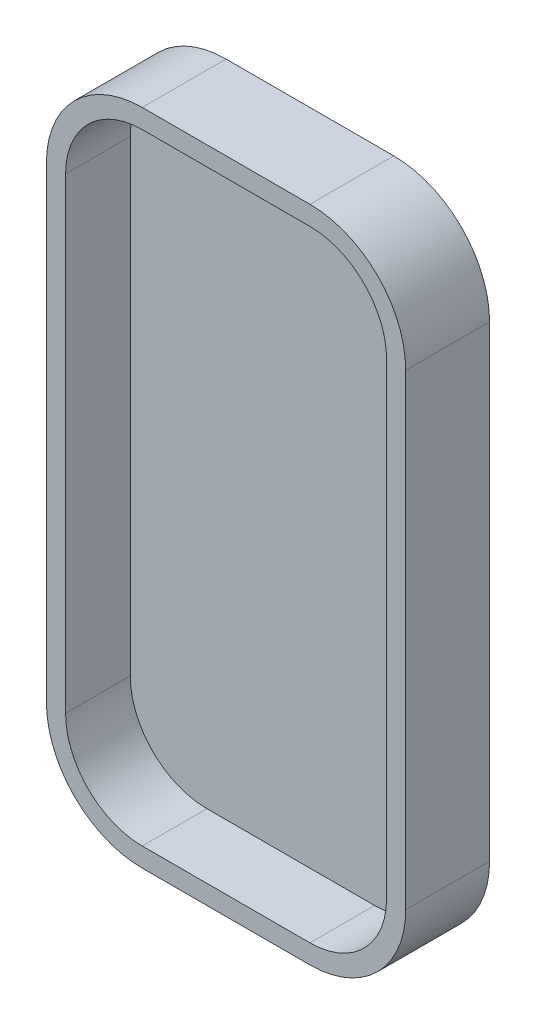
ISO-10303-21;
HEADER;
FILE_DESCRIPTION(('STEP AP214'),'2;1');
FILE_NAME('part.step','',(''),(''),'','','');
FILE_SCHEMA(('AUTOMOTIVE_DESIGN { 1 0 10303 214 1 1 1 1 }'));
ENDSEC;
DATA;
#1=APPLICATION_CONTEXT('core data for automotive mechanical design processes');
#2=APPLICATION_PROTOCOL_DEFINITION('international standard','automotive_design',2000,#1);
#3=PRODUCT_CONTEXT('',#1,'mechanical');
#4=PRODUCT('Part','Part','',(#3));
#5=PRODUCT_RELATED_PRODUCT_CATEGORY('part','',(#4));
#6=PRODUCT_DEFINITION_FORMATION('','',#4);
#7=PRODUCT_DEFINITION_CONTEXT('part definition',#1,'design');
#8=PRODUCT_DEFINITION('design','',#6,#7);
#9=PRODUCT_DEFINITION_SHAPE('','',#8);
#10=(LENGTH_UNIT() NAMED_UNIT(*) SI_UNIT(.MILLI.,.METRE.));
#11=(NAMED_UNIT(*) PLANE_ANGLE_UNIT() SI_UNIT($,.RADIAN.));
#12=(NAMED_UNIT(*) SI_UNIT($,.STERADIAN.) SOLID_ANGLE_UNIT());
#13=UNCERTAINTY_MEASURE_WITH_UNIT(LENGTH_MEASURE(1.E-05),#10,'distance_accuracy_value','');
#14=(GEOMETRIC_REPRESENTATION_CONTEXT(3) GLOBAL_UNCERTAINTY_ASSIGNED_CONTEXT((#13)) GLOBAL_UNIT_ASSIGNED_CONTEXT((#10,
#11,#12)) REPRESENTATION_CONTEXT('',''));
#15=CARTESIAN_POINT('',(0.,0.,0.));
#16=DIRECTION('',(0.,0.,1.));
#17=DIRECTION('',(1.,0.,0.));
#18=AXIS2_PLACEMENT_3D('',#15,#16,#17);
#19=CARTESIAN_POINT('',(-7.,-19.5,7.));
#20=DIRECTION('',(0.,0.,-1.));
#21=DIRECTION('',(-1.,0.,0.));
#22=AXIS2_PLACEMENT_3D('',#19,#20,#21);
#23=CYLINDRICAL_SURFACE('',#22,8.);
#24=CARTESIAN_POINT('',(-7.,-19.5,0.));
#25=DIRECTION('',(0.,0.,1.));
#26=DIRECTION('',(1.,0.,0.));
#27=AXIS2_PLACEMENT_3D('',#24,#25,#26);
#28=CIRCLE('',#27,8.);
#29=CARTESIAN_POINT('',(-15.,-19.4999999999999,0.));
#30=VERTEX_POINT('',#29);
#31=CARTESIAN_POINT('',(-6.99999999999994,-27.5,0.));
#32=VERTEX_POINT('',#31);
#33=EDGE_CURVE('E151',#30,#32,#28,.T.);
#34=ORIENTED_EDGE('',*,*,#33,.T.);
#35=DIRECTION('',(0.,0.,-1.));
#36=VECTOR('',#35,1.);
#37=CARTESIAN_POINT('',(-6.99999999999994,-27.5,7.));
#38=LINE('',#37,#36);
#39=CARTESIAN_POINT('',(-6.99999999999994,-27.5,7.));
#40=VERTEX_POINT('',#39);
#41=EDGE_CURVE('E11',#40,#32,#38,.T.);
#42=ORIENTED_EDGE('',*,*,#41,.F.);
#43=CARTESIAN_POINT('',(-7.,-19.5,7.));
#44=DIRECTION('',(0.,0.,1.));
#45=DIRECTION('',(1.,0.,0.));
#46=AXIS2_PLACEMENT_3D('',#43,#44,#45);
#47=CIRCLE('',#46,8.);
#48=CARTESIAN_POINT('',(-15.,-19.4999999999999,7.));
#49=VERTEX_POINT('',#48);
#50=EDGE_CURVE('E167',#49,#40,#47,.T.);
#51=ORIENTED_EDGE('',*,*,#50,.F.);
#52=DIRECTION('',(0.,0.,-1.));
#53=VECTOR('',#52,1.);
#54=CARTESIAN_POINT('',(-15.,-19.4999999999999,7.));
#55=LINE('',#54,#53);
#56=EDGE_CURVE('E147',#49,#30,#55,.T.);
#57=ORIENTED_EDGE('',*,*,#56,.T.);
#58=EDGE_LOOP('',(#34,#42,#51,#57));
#59=FACE_BOUND('',#58,.T.);
#60=ADVANCED_FACE('F43',(#59),#23,.T.);
#61=CARTESIAN_POINT('',(-6.99999999999994,-27.5,7.));
#62=DIRECTION('',(0.,1.,0.));
#63=DIRECTION('',(-1.,0.,0.));
#64=AXIS2_PLACEMENT_3D('',#61,#62,#63);
#65=PLANE('',#64);
#66=DIRECTION('',(1.,0.,0.));
#67=VECTOR('',#66,1.);
#68=CARTESIAN_POINT('',(-6.99999999999994,-27.5,0.));
#69=LINE('',#68,#67);
#70=CARTESIAN_POINT('',(6.99999999999994,-27.5,0.));
#71=VERTEX_POINT('',#70);
#72=EDGE_CURVE('E154',#32,#71,#69,.T.);
#73=ORIENTED_EDGE('',*,*,#72,.T.);
#74=DIRECTION('',(0.,0.,-1.));
#75=VECTOR('',#74,1.);
#76=CARTESIAN_POINT('',(6.99999999999994,-27.5,7.));
#77=LINE('',#76,#75);
#78=CARTESIAN_POINT('',(6.99999999999994,-27.5,7.));
#79=VERTEX_POINT('',#78);
#80=EDGE_CURVE('E50',#79,#71,#77,.T.);
#81=ORIENTED_EDGE('',*,*,#80,.F.);
#82=DIRECTION('',(1.,0.,0.));
#83=VECTOR('',#82,1.);
#84=CARTESIAN_POINT('',(-6.99999999999994,-27.5,7.));
#85=LINE('',#84,#83);
#86=EDGE_CURVE('E107',#40,#79,#85,.T.);
#87=ORIENTED_EDGE('',*,*,#86,.F.);
#88=ORIENTED_EDGE('',*,*,#41,.T.);
#89=EDGE_LOOP('',(#73,#81,#87,#88));
#90=FACE_BOUND('',#89,.T.);
#91=ADVANCED_FACE('F341',(#90),#65,.F.);
#92=CARTESIAN_POINT('',(7.,-19.5,7.));
#93=DIRECTION('',(0.,0.,-1.));
#94=DIRECTION('',(-1.,0.,0.));
#95=AXIS2_PLACEMENT_3D('',#92,#93,#94);
#96=CYLINDRICAL_SURFACE('',#95,8.);
#97=CARTESIAN_POINT('',(7.,-19.5,0.));
#98=DIRECTION('',(0.,0.,1.));
#99=DIRECTION('',(1.,0.,0.));
#100=AXIS2_PLACEMENT_3D('',#97,#98,#99);
#101=CIRCLE('',#100,8.);
#102=CARTESIAN_POINT('',(15.,-19.4999999999999,0.));
#103=VERTEX_POINT('',#102);
#104=EDGE_CURVE('E157',#71,#103,#101,.T.);
#105=ORIENTED_EDGE('',*,*,#104,.T.);
#106=DIRECTION('',(0.,0.,-1.));
#107=VECTOR('',#106,1.);
#108=CARTESIAN_POINT('',(15.,-19.4999999999999,7.));
#109=LINE('',#108,#107);
#110=CARTESIAN_POINT('',(15.,-19.4999999999999,7.));
#111=VERTEX_POINT('',#110);
#112=EDGE_CURVE('E174',#111,#103,#109,.T.);
#113=ORIENTED_EDGE('',*,*,#112,.F.);
#114=CARTESIAN_POINT('',(7.,-19.5,7.));
#115=DIRECTION('',(0.,0.,1.));
#116=DIRECTION('',(1.,0.,0.));
#117=AXIS2_PLACEMENT_3D('',#114,#115,#116);
#118=CIRCLE('',#117,8.);
#119=EDGE_CURVE('E182',#79,#111,#118,.T.);
#120=ORIENTED_EDGE('',*,*,#119,.F.);
#121=ORIENTED_EDGE('',*,*,#80,.T.);
#122=EDGE_LOOP('',(#105,#113,#120,#121));
#123=FACE_BOUND('',#122,.T.);
#124=ADVANCED_FACE('F180',(#123),#96,.T.);
#125=CARTESIAN_POINT('',(15.,-19.4999999999999,7.));
#126=DIRECTION('',(-1.,0.,0.));
#127=DIRECTION('',(0.,0.,1.));
#128=AXIS2_PLACEMENT_3D('',#125,#126,#127);
#129=PLANE('',#128);
#130=DIRECTION('',(0.,1.,0.));
#131=VECTOR('',#130,1.);
#132=CARTESIAN_POINT('',(15.,-19.4999999999999,0.));
#133=LINE('',#132,#131);
#134=CARTESIAN_POINT('',(15.,19.4999999999999,0.));
#135=VERTEX_POINT('',#134);
#136=EDGE_CURVE('E159',#103,#135,#133,.T.);
#137=ORIENTED_EDGE('',*,*,#136,.T.);
#138=DIRECTION('',(0.,0.,-1.));
#139=VECTOR('',#138,1.);
#140=CARTESIAN_POINT('',(15.,19.4999999999999,7.));
#141=LINE('',#140,#139);
#142=CARTESIAN_POINT('',(15.,19.4999999999999,7.));
#143=VERTEX_POINT('',#142);
#144=EDGE_CURVE('E171',#143,#135,#141,.T.);
#145=ORIENTED_EDGE('',*,*,#144,.F.);
#146=DIRECTION('',(0.,1.,0.));
#147=VECTOR('',#146,1.);
#148=CARTESIAN_POINT('',(15.,-19.4999999999999,7.));
#149=LINE('',#148,#147);
#150=EDGE_CURVE('E194',#111,#143,#149,.T.);
#151=ORIENTED_EDGE('',*,*,#150,.F.);
#152=ORIENTED_EDGE('',*,*,#112,.T.);
#153=EDGE_LOOP('',(#137,#145,#151,#152));
#154=FACE_BOUND('',#153,.T.);
#155=ADVANCED_FACE('F190',(#154),#129,.F.);
#156=CARTESIAN_POINT('',(7.,19.5,7.));
#157=DIRECTION('',(0.,0.,-1.));
#158=DIRECTION('',(-1.,0.,0.));
#159=AXIS2_PLACEMENT_3D('',#156,#157,#158);
#160=CYLINDRICAL_SURFACE('',#159,8.);
#161=CARTESIAN_POINT('',(7.,19.5,0.));
#162=DIRECTION('',(0.,0.,1.));
#163=DIRECTION('',(1.,0.,0.));
#164=AXIS2_PLACEMENT_3D('',#161,#162,#163);
#165=CIRCLE('',#164,8.);
#166=CARTESIAN_POINT('',(6.99999999999994,27.5,0.));
#167=VERTEX_POINT('',#166);
#168=EDGE_CURVE('E161',#135,#167,#165,.T.);
#169=ORIENTED_EDGE('',*,*,#168,.T.);
#170=DIRECTION('',(0.,0.,-1.));
#171=VECTOR('',#170,1.);
#172=CARTESIAN_POINT('',(6.99999999999994,27.5,7.));
#173=LINE('',#172,#171);
#174=CARTESIAN_POINT('',(6.99999999999994,27.5,7.));
#175=VERTEX_POINT('',#174);
#176=EDGE_CURVE('E142',#175,#167,#173,.T.);
#177=ORIENTED_EDGE('',*,*,#176,.F.);
#178=CARTESIAN_POINT('',(7.,19.5,7.));
#179=DIRECTION('',(0.,0.,1.));
#180=DIRECTION('',(1.,0.,0.));
#181=AXIS2_PLACEMENT_3D('',#178,#179,#180);
#182=CIRCLE('',#181,8.);
#183=EDGE_CURVE('E130',#143,#175,#182,.T.);
#184=ORIENTED_EDGE('',*,*,#183,.F.);
#185=ORIENTED_EDGE('',*,*,#144,.T.);
#186=EDGE_LOOP('',(#169,#177,#184,#185));
#187=FACE_BOUND('',#186,.T.);
#188=ADVANCED_FACE('F193',(#187),#160,.T.);
#189=CARTESIAN_POINT('',(-6.99999999999994,27.5,7.));
#190=DIRECTION('',(0.,-1.,0.));
#191=DIRECTION('',(1.,0.,0.));
#192=AXIS2_PLACEMENT_3D('',#189,#190,#191);
#193=PLANE('',#192);
#194=DIRECTION('',(-1.,0.,0.));
#195=VECTOR('',#194,1.);
#196=CARTESIAN_POINT('',(-6.99999999999994,27.5,0.));
#197=LINE('',#196,#195);
#198=CARTESIAN_POINT('',(-6.99999999999994,27.5,0.));
#199=VERTEX_POINT('',#198);
#200=EDGE_CURVE('E139',#167,#199,#197,.T.);
#201=ORIENTED_EDGE('',*,*,#200,.T.);
#202=DIRECTION('',(0.,0.,-1.));
#203=VECTOR('',#202,1.);
#204=CARTESIAN_POINT('',(-6.99999999999994,27.5,7.));
#205=LINE('',#204,#203);
#206=CARTESIAN_POINT('',(-6.99999999999994,27.5,7.));
#207=VERTEX_POINT('',#206);
#208=EDGE_CURVE('E136',#207,#199,#205,.T.);
#209=ORIENTED_EDGE('',*,*,#208,.F.);
#210=DIRECTION('',(-1.,0.,0.));
#211=VECTOR('',#210,1.);
#212=CARTESIAN_POINT('',(-6.99999999999994,27.5,7.));
#213=LINE('',#212,#211);
#214=EDGE_CURVE('E123',#175,#207,#213,.T.);
#215=ORIENTED_EDGE('',*,*,#214,.F.);
#216=ORIENTED_EDGE('',*,*,#176,.T.);
#217=EDGE_LOOP('',(#201,#209,#215,#216));
#218=FACE_BOUND('',#217,.T.);
#219=ADVANCED_FACE('F137',(#218),#193,.F.);
#220=CARTESIAN_POINT('',(-7.,19.5,7.));
#221=DIRECTION('',(0.,0.,-1.));
#222=DIRECTION('',(-1.,0.,0.));
#223=AXIS2_PLACEMENT_3D('',#220,#221,#222);
#224=CYLINDRICAL_SURFACE('',#223,8.);
#225=CARTESIAN_POINT('',(-7.,19.5,0.));
#226=DIRECTION('',(0.,0.,1.));
#227=DIRECTION('',(-1.,0.,0.));
#228=AXIS2_PLACEMENT_3D('',#225,#226,#227);
#229=CIRCLE('',#228,8.);
#230=CARTESIAN_POINT('',(-15.,19.4999999999999,0.));
#231=VERTEX_POINT('',#230);
#232=EDGE_CURVE('E164',#199,#231,#229,.T.);
#233=ORIENTED_EDGE('',*,*,#232,.T.);
#234=DIRECTION('',(0.,0.,-1.));
#235=VECTOR('',#234,1.);
#236=CARTESIAN_POINT('',(-15.,19.4999999999999,7.));
#237=LINE('',#236,#235);
#238=CARTESIAN_POINT('',(-15.,19.4999999999999,7.));
#239=VERTEX_POINT('',#238);
#240=EDGE_CURVE('E143',#239,#231,#237,.T.);
#241=ORIENTED_EDGE('',*,*,#240,.F.);
#242=CARTESIAN_POINT('',(-7.,19.5,7.));
#243=DIRECTION('',(0.,0.,1.));
#244=DIRECTION('',(-1.,0.,0.));
#245=AXIS2_PLACEMENT_3D('',#242,#243,#244);
#246=CIRCLE('',#245,8.);
#247=EDGE_CURVE('E127',#207,#239,#246,.T.);
#248=ORIENTED_EDGE('',*,*,#247,.F.);
#249=ORIENTED_EDGE('',*,*,#208,.T.);
#250=EDGE_LOOP('',(#233,#241,#248,#249));
#251=FACE_BOUND('',#250,.T.);
#252=ADVANCED_FACE('F145',(#251),#224,.T.);
#253=CARTESIAN_POINT('',(-15.,-19.4999999999999,7.));
#254=DIRECTION('',(1.,0.,0.));
#255=DIRECTION('',(0.,0.,-1.));
#256=AXIS2_PLACEMENT_3D('',#253,#254,#255);
#257=PLANE('',#256);
#258=DIRECTION('',(0.,-1.,0.));
#259=VECTOR('',#258,1.);
#260=CARTESIAN_POINT('',(-15.,-19.4999999999999,0.));
#261=LINE('',#260,#259);
#262=EDGE_CURVE('E99',#231,#30,#261,.T.);
#263=ORIENTED_EDGE('',*,*,#262,.T.);
#264=ORIENTED_EDGE('',*,*,#56,.F.);
#265=DIRECTION('',(0.,-1.,0.));
#266=VECTOR('',#265,1.);
#267=CARTESIAN_POINT('',(-15.,-19.4999999999999,7.));
#268=LINE('',#267,#266);
#269=EDGE_CURVE('E66',#239,#49,#268,.T.);
#270=ORIENTED_EDGE('',*,*,#269,.F.);
#271=ORIENTED_EDGE('',*,*,#240,.T.);
#272=EDGE_LOOP('',(#263,#264,#270,#271));
#273=FACE_BOUND('',#272,.T.);
#274=ADVANCED_FACE('F348',(#273),#257,.F.);
#275=CARTESIAN_POINT('',(-7.,-19.5,7.));
#276=DIRECTION('',(0.,0.,1.));
#277=DIRECTION('',(1.,0.,0.));
#278=AXIS2_PLACEMENT_3D('',#275,#276,#277);
#279=PLANE('',#278);
#280=CARTESIAN_POINT('',(7.,-19.5,7.));
#281=DIRECTION('',(0.,0.,1.));
#282=DIRECTION('',(1.,0.,0.));
#283=AXIS2_PLACEMENT_3D('',#280,#281,#282);
#284=CIRCLE('',#283,6.4);
#285=CARTESIAN_POINT('',(6.99999999999995,-25.9,7.));
#286=VERTEX_POINT('',#285);
#287=CARTESIAN_POINT('',(13.4,-19.5,7.));
#288=VERTEX_POINT('',#287);
#289=EDGE_CURVE('E57',#286,#288,#284,.T.);
#290=ORIENTED_EDGE('',*,*,#289,.F.);
#291=DIRECTION('',(1.,0.,0.));
#292=VECTOR('',#291,1.);
#293=CARTESIAN_POINT('',(6.99999999999995,-25.9,7.));
#294=LINE('',#293,#292);
#295=CARTESIAN_POINT('',(-6.99999999999995,-25.9,7.));
#296=VERTEX_POINT('',#295);
#297=EDGE_CURVE('E222',#296,#286,#294,.T.);
#298=ORIENTED_EDGE('',*,*,#297,.F.);
#299=CARTESIAN_POINT('',(-7.,-19.5,7.));
#300=DIRECTION('',(0.,0.,1.));
#301=DIRECTION('',(-1.,0.,0.));
#302=AXIS2_PLACEMENT_3D('',#299,#300,#301);
#303=CIRCLE('',#302,6.4);
#304=CARTESIAN_POINT('',(-13.4,-19.5,7.));
#305=VERTEX_POINT('',#304);
#306=EDGE_CURVE('E226',#305,#296,#303,.T.);
#307=ORIENTED_EDGE('',*,*,#306,.F.);
#308=DIRECTION('',(0.,-1.,0.));
#309=VECTOR('',#308,1.);
#310=CARTESIAN_POINT('',(-13.4,-19.5,7.));
#311=LINE('',#310,#309);
#312=CARTESIAN_POINT('',(-13.4,19.5,7.));
#313=VERTEX_POINT('',#312);
#314=EDGE_CURVE('E229',#313,#305,#311,.T.);
#315=ORIENTED_EDGE('',*,*,#314,.F.);
#316=CARTESIAN_POINT('',(-7.,19.5,7.));
#317=DIRECTION('',(0.,0.,1.));
#318=DIRECTION('',(1.,0.,0.));
#319=AXIS2_PLACEMENT_3D('',#316,#317,#318);
#320=CIRCLE('',#319,6.4);
#321=CARTESIAN_POINT('',(-6.99999999999995,25.9,7.));
#322=VERTEX_POINT('',#321);
#323=EDGE_CURVE('E232',#322,#313,#320,.T.);
#324=ORIENTED_EDGE('',*,*,#323,.F.);
#325=DIRECTION('',(-1.,0.,0.));
#326=VECTOR('',#325,1.);
#327=CARTESIAN_POINT('',(6.99999999999995,25.9,7.));
#328=LINE('',#327,#326);
#329=CARTESIAN_POINT('',(6.99999999999995,25.9,7.));
#330=VERTEX_POINT('',#329);
#331=EDGE_CURVE('E235',#330,#322,#328,.T.);
#332=ORIENTED_EDGE('',*,*,#331,.F.);
#333=CARTESIAN_POINT('',(7.,19.5,7.));
#334=DIRECTION('',(0.,0.,1.));
#335=DIRECTION('',(1.,0.,0.));
#336=AXIS2_PLACEMENT_3D('',#333,#334,#335);
#337=CIRCLE('',#336,6.4);
#338=CARTESIAN_POINT('',(13.4,19.5,7.));
#339=VERTEX_POINT('',#338);
#340=EDGE_CURVE('E238',#339,#330,#337,.T.);
#341=ORIENTED_EDGE('',*,*,#340,.F.);
#342=DIRECTION('',(0.,1.,0.));
#343=VECTOR('',#342,1.);
#344=CARTESIAN_POINT('',(13.4,-19.5,7.));
#345=LINE('',#344,#343);
#346=EDGE_CURVE('E241',#288,#339,#345,.T.);
#347=ORIENTED_EDGE('',*,*,#346,.F.);
#348=EDGE_LOOP('',(#290,#298,#307,#315,#324,#332,#341,#347));
#349=FACE_BOUND('',#348,.T.);
#350=ORIENTED_EDGE('',*,*,#50,.T.);
#351=ORIENTED_EDGE('',*,*,#86,.T.);
#352=ORIENTED_EDGE('',*,*,#119,.T.);
#353=ORIENTED_EDGE('',*,*,#150,.T.);
#354=ORIENTED_EDGE('',*,*,#183,.T.);
#355=ORIENTED_EDGE('',*,*,#214,.T.);
#356=ORIENTED_EDGE('',*,*,#247,.T.);
#357=ORIENTED_EDGE('',*,*,#269,.T.);
#358=EDGE_LOOP('',(#350,#351,#352,#353,#354,#355,#356,#357));
#359=FACE_BOUND('',#358,.T.);
#360=ADVANCED_FACE('F125',(#349,#359),#279,.T.);
#361=CARTESIAN_POINT('',(-7.,-19.5,0.));
#362=DIRECTION('',(0.,0.,1.));
#363=DIRECTION('',(1.,0.,0.));
#364=AXIS2_PLACEMENT_3D('',#361,#362,#363);
#365=PLANE('',#364);
#366=ORIENTED_EDGE('',*,*,#33,.F.);
#367=ORIENTED_EDGE('',*,*,#262,.F.);
#368=ORIENTED_EDGE('',*,*,#232,.F.);
#369=ORIENTED_EDGE('',*,*,#200,.F.);
#370=ORIENTED_EDGE('',*,*,#168,.F.);
#371=ORIENTED_EDGE('',*,*,#136,.F.);
#372=ORIENTED_EDGE('',*,*,#104,.F.);
#373=ORIENTED_EDGE('',*,*,#72,.F.);
#374=EDGE_LOOP('',(#366,#367,#368,#369,#370,#371,#372,#373));
#375=FACE_BOUND('',#374,.T.);
#376=ADVANCED_FACE('F186',(#375),#365,.F.);
#377=CARTESIAN_POINT('',(7.,-19.5,1.6));
#378=DIRECTION('',(0.,0.,1.));
#379=DIRECTION('',(1.,0.,0.));
#380=AXIS2_PLACEMENT_3D('',#377,#378,#379);
#381=CYLINDRICAL_SURFACE('',#380,6.4);
#382=ORIENTED_EDGE('',*,*,#289,.T.);
#383=DIRECTION('',(0.,0.,1.));
#384=VECTOR('',#383,1.);
#385=CARTESIAN_POINT('',(13.4,-19.5,1.6));
#386=LINE('',#385,#384);
#387=CARTESIAN_POINT('',(13.4,-19.5,1.6));
#388=VERTEX_POINT('',#387);
#389=EDGE_CURVE('E200',#388,#288,#386,.T.);
#390=ORIENTED_EDGE('',*,*,#389,.F.);
#391=CARTESIAN_POINT('',(7.,-19.5,1.6));
#392=DIRECTION('',(0.,0.,1.));
#393=DIRECTION('',(1.,0.,0.));
#394=AXIS2_PLACEMENT_3D('',#391,#392,#393);
#395=CIRCLE('',#394,6.4);
#396=CARTESIAN_POINT('',(6.99999999999995,-25.9,1.6));
#397=VERTEX_POINT('',#396);
#398=EDGE_CURVE('E225',#397,#388,#395,.T.);
#399=ORIENTED_EDGE('',*,*,#398,.F.);
#400=DIRECTION('',(0.,0.,1.));
#401=VECTOR('',#400,1.);
#402=CARTESIAN_POINT('',(6.99999999999995,-25.9,1.6));
#403=LINE('',#402,#401);
#404=EDGE_CURVE('E155',#397,#286,#403,.T.);
#405=ORIENTED_EDGE('',*,*,#404,.T.);
#406=EDGE_LOOP('',(#382,#390,#399,#405));
#407=FACE_BOUND('',#406,.T.);
#408=ADVANCED_FACE('F274',(#407),#381,.F.);
#409=CARTESIAN_POINT('',(6.99999999999995,-25.9,1.6));
#410=DIRECTION('',(0.,-1.,0.));
#411=DIRECTION('',(0.,0.,-1.));
#412=AXIS2_PLACEMENT_3D('',#409,#410,#411);
#413=PLANE('',#412);
#414=ORIENTED_EDGE('',*,*,#297,.T.);
#415=ORIENTED_EDGE('',*,*,#404,.F.);
#416=DIRECTION('',(1.,0.,0.));
#417=VECTOR('',#416,1.);
#418=CARTESIAN_POINT('',(6.99999999999995,-25.9,1.6));
#419=LINE('',#418,#417);
#420=CARTESIAN_POINT('',(-6.99999999999995,-25.9,1.6));
#421=VERTEX_POINT('',#420);
#422=EDGE_CURVE('E203',#421,#397,#419,.T.);
#423=ORIENTED_EDGE('',*,*,#422,.F.);
#424=DIRECTION('',(0.,0.,1.));
#425=VECTOR('',#424,1.);
#426=CARTESIAN_POINT('',(-6.99999999999995,-25.9,1.6));
#427=LINE('',#426,#425);
#428=EDGE_CURVE('E218',#421,#296,#427,.T.);
#429=ORIENTED_EDGE('',*,*,#428,.T.);
#430=EDGE_LOOP('',(#414,#415,#423,#429));
#431=FACE_BOUND('',#430,.T.);
#432=ADVANCED_FACE('F294',(#431),#413,.F.);
#433=CARTESIAN_POINT('',(-7.,-19.5,1.6));
#434=DIRECTION('',(0.,0.,1.));
#435=DIRECTION('',(1.,0.,0.));
#436=AXIS2_PLACEMENT_3D('',#433,#434,#435);
#437=CYLINDRICAL_SURFACE('',#436,6.4);
#438=ORIENTED_EDGE('',*,*,#306,.T.);
#439=ORIENTED_EDGE('',*,*,#428,.F.);
#440=CARTESIAN_POINT('',(-7.,-19.5,1.6));
#441=DIRECTION('',(0.,0.,1.));
#442=DIRECTION('',(-1.,0.,0.));
#443=AXIS2_PLACEMENT_3D('',#440,#441,#442);
#444=CIRCLE('',#443,6.4);
#445=CARTESIAN_POINT('',(-13.4,-19.5,1.6));
#446=VERTEX_POINT('',#445);
#447=EDGE_CURVE('E247',#446,#421,#444,.T.);
#448=ORIENTED_EDGE('',*,*,#447,.F.);
#449=DIRECTION('',(0.,0.,1.));
#450=VECTOR('',#449,1.);
#451=CARTESIAN_POINT('',(-13.4,-19.5,1.6));
#452=LINE('',#451,#450);
#453=EDGE_CURVE('E215',#446,#305,#452,.T.);
#454=ORIENTED_EDGE('',*,*,#453,.T.);
#455=EDGE_LOOP('',(#438,#439,#448,#454));
#456=FACE_BOUND('',#455,.T.);
#457=ADVANCED_FACE('F299',(#456),#437,.F.);
#458=CARTESIAN_POINT('',(-13.4,-19.5,1.6));
#459=DIRECTION('',(-1.,0.,0.));
#460=DIRECTION('',(0.,-1.,0.));
#461=AXIS2_PLACEMENT_3D('',#458,#459,#460);
#462=PLANE('',#461);
#463=ORIENTED_EDGE('',*,*,#314,.T.);
#464=ORIENTED_EDGE('',*,*,#453,.F.);
#465=DIRECTION('',(0.,-1.,0.));
#466=VECTOR('',#465,1.);
#467=CARTESIAN_POINT('',(-13.4,-19.5,1.6));
#468=LINE('',#467,#466);
#469=CARTESIAN_POINT('',(-13.4,19.5,1.6));
#470=VERTEX_POINT('',#469);
#471=EDGE_CURVE('E250',#470,#446,#468,.T.);
#472=ORIENTED_EDGE('',*,*,#471,.F.);
#473=DIRECTION('',(0.,0.,1.));
#474=VECTOR('',#473,1.);
#475=CARTESIAN_POINT('',(-13.4,19.5,1.6));
#476=LINE('',#475,#474);
#477=EDGE_CURVE('E212',#470,#313,#476,.T.);
#478=ORIENTED_EDGE('',*,*,#477,.T.);
#479=EDGE_LOOP('',(#463,#464,#472,#478));
#480=FACE_BOUND('',#479,.T.);
#481=ADVANCED_FACE('F325',(#480),#462,.F.);
#482=CARTESIAN_POINT('',(-7.,19.5,1.6));
#483=DIRECTION('',(0.,0.,1.));
#484=DIRECTION('',(1.,0.,0.));
#485=AXIS2_PLACEMENT_3D('',#482,#483,#484);
#486=CYLINDRICAL_SURFACE('',#485,6.4);
#487=ORIENTED_EDGE('',*,*,#323,.T.);
#488=ORIENTED_EDGE('',*,*,#477,.F.);
#489=CARTESIAN_POINT('',(-7.,19.5,1.6));
#490=DIRECTION('',(0.,0.,1.));
#491=DIRECTION('',(1.,0.,0.));
#492=AXIS2_PLACEMENT_3D('',#489,#490,#491);
#493=CIRCLE('',#492,6.4);
#494=CARTESIAN_POINT('',(-6.99999999999995,25.9,1.6));
#495=VERTEX_POINT('',#494);
#496=EDGE_CURVE('E253',#495,#470,#493,.T.);
#497=ORIENTED_EDGE('',*,*,#496,.F.);
#498=DIRECTION('',(0.,0.,1.));
#499=VECTOR('',#498,1.);
#500=CARTESIAN_POINT('',(-6.99999999999995,25.9,1.6));
#501=LINE('',#500,#499);
#502=EDGE_CURVE('E209',#495,#322,#501,.T.);
#503=ORIENTED_EDGE('',*,*,#502,.T.);
#504=EDGE_LOOP('',(#487,#488,#497,#503));
#505=FACE_BOUND('',#504,.T.);
#506=ADVANCED_FACE('F328',(#505),#486,.F.);
#507=CARTESIAN_POINT('',(6.99999999999995,25.9,1.6));
#508=DIRECTION('',(0.,1.,0.));
#509=DIRECTION('',(0.,0.,1.));
#510=AXIS2_PLACEMENT_3D('',#507,#508,#509);
#511=PLANE('',#510);
#512=ORIENTED_EDGE('',*,*,#331,.T.);
#513=ORIENTED_EDGE('',*,*,#502,.F.);
#514=DIRECTION('',(-1.,0.,0.));
#515=VECTOR('',#514,1.);
#516=CARTESIAN_POINT('',(6.99999999999995,25.9,1.6));
#517=LINE('',#516,#515);
#518=CARTESIAN_POINT('',(6.99999999999995,25.9,1.6));
#519=VERTEX_POINT('',#518);
#520=EDGE_CURVE('E256',#519,#495,#517,.T.);
#521=ORIENTED_EDGE('',*,*,#520,.F.);
#522=DIRECTION('',(0.,0.,1.));
#523=VECTOR('',#522,1.);
#524=CARTESIAN_POINT('',(6.99999999999995,25.9,1.6));
#525=LINE('',#524,#523);
#526=EDGE_CURVE('E206',#519,#330,#525,.T.);
#527=ORIENTED_EDGE('',*,*,#526,.T.);
#528=EDGE_LOOP('',(#512,#513,#521,#527));
#529=FACE_BOUND('',#528,.T.);
#530=ADVANCED_FACE('F331',(#529),#511,.F.);
#531=CARTESIAN_POINT('',(7.,19.5,1.6));
#532=DIRECTION('',(0.,0.,1.));
#533=DIRECTION('',(1.,0.,0.));
#534=AXIS2_PLACEMENT_3D('',#531,#532,#533);
#535=CYLINDRICAL_SURFACE('',#534,6.4);
#536=ORIENTED_EDGE('',*,*,#340,.T.);
#537=ORIENTED_EDGE('',*,*,#526,.F.);
#538=CARTESIAN_POINT('',(7.,19.5,1.6));
#539=DIRECTION('',(0.,0.,1.));
#540=DIRECTION('',(1.,0.,0.));
#541=AXIS2_PLACEMENT_3D('',#538,#539,#540);
#542=CIRCLE('',#541,6.4);
#543=CARTESIAN_POINT('',(13.4,19.5,1.6));
#544=VERTEX_POINT('',#543);
#545=EDGE_CURVE('E259',#544,#519,#542,.T.);
#546=ORIENTED_EDGE('',*,*,#545,.F.);
#547=DIRECTION('',(0.,0.,1.));
#548=VECTOR('',#547,1.);
#549=CARTESIAN_POINT('',(13.4,19.5,1.6));
#550=LINE('',#549,#548);
#551=EDGE_CURVE('E202',#544,#339,#550,.T.);
#552=ORIENTED_EDGE('',*,*,#551,.T.);
#553=EDGE_LOOP('',(#536,#537,#546,#552));
#554=FACE_BOUND('',#553,.T.);
#555=ADVANCED_FACE('F314',(#554),#535,.F.);
#556=CARTESIAN_POINT('',(13.4,-19.5,1.6));
#557=DIRECTION('',(1.,0.,0.));
#558=DIRECTION('',(0.,0.,-1.));
#559=AXIS2_PLACEMENT_3D('',#556,#557,#558);
#560=PLANE('',#559);
#561=ORIENTED_EDGE('',*,*,#346,.T.);
#562=ORIENTED_EDGE('',*,*,#551,.F.);
#563=DIRECTION('',(0.,1.,0.));
#564=VECTOR('',#563,1.);
#565=CARTESIAN_POINT('',(13.4,-19.5,1.6));
#566=LINE('',#565,#564);
#567=EDGE_CURVE('E262',#388,#544,#566,.T.);
#568=ORIENTED_EDGE('',*,*,#567,.F.);
#569=ORIENTED_EDGE('',*,*,#389,.T.);
#570=EDGE_LOOP('',(#561,#562,#568,#569));
#571=FACE_BOUND('',#570,.T.);
#572=ADVANCED_FACE('F308',(#571),#560,.F.);
#573=CARTESIAN_POINT('',(7.,-19.5,1.6));
#574=DIRECTION('',(0.,0.,1.));
#575=DIRECTION('',(1.,0.,0.));
#576=AXIS2_PLACEMENT_3D('',#573,#574,#575);
#577=PLANE('',#576);
#578=ORIENTED_EDGE('',*,*,#398,.T.);
#579=ORIENTED_EDGE('',*,*,#567,.T.);
#580=ORIENTED_EDGE('',*,*,#545,.T.);
#581=ORIENTED_EDGE('',*,*,#520,.T.);
#582=ORIENTED_EDGE('',*,*,#496,.T.);
#583=ORIENTED_EDGE('',*,*,#471,.T.);
#584=ORIENTED_EDGE('',*,*,#447,.T.);
#585=ORIENTED_EDGE('',*,*,#422,.T.);
#586=EDGE_LOOP('',(#578,#579,#580,#581,#582,#583,#584,#585));
#587=FACE_BOUND('',#586,.T.);
#588=ADVANCED_FACE('F269',(#587),#577,.T.);
#589=CLOSED_SHELL('',(#60,#91,#124,#155,#188,#219,#252,#274,#360,#376,#408,#432,#457,#481,#506,
#530,#555,#572,#588));
#590=MANIFOLD_SOLID_BREP('B2',#589);
#591=ADVANCED_BREP_SHAPE_REPRESENTATION('',(#18,#590),#14);
#592=SHAPE_DEFINITION_REPRESENTATION(#9,#591);
ENDSEC;
END-ISO-10303-21;
